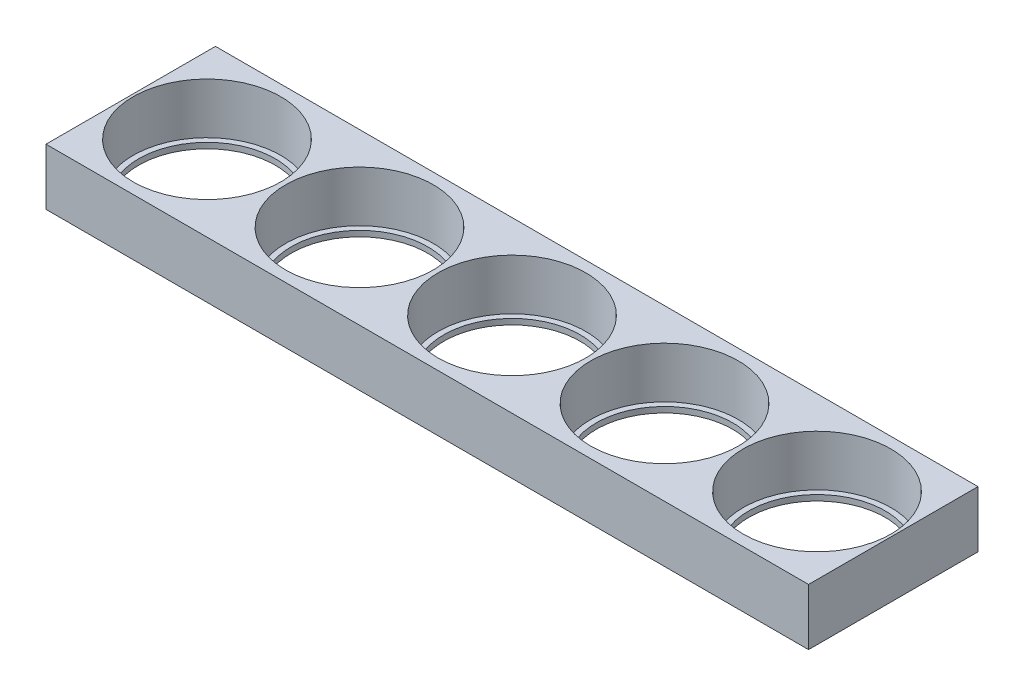
ISO-10303-21;
HEADER;
FILE_DESCRIPTION(('STEP AP214'),'2;1');
FILE_NAME('part.step','',(''),(''),'','','');
FILE_SCHEMA(('AUTOMOTIVE_DESIGN { 1 0 10303 214 1 1 1 1 }'));
ENDSEC;
DATA;
#1=APPLICATION_CONTEXT('core data for automotive mechanical design processes');
#2=APPLICATION_PROTOCOL_DEFINITION('international standard','automotive_design',2000,#1);
#3=PRODUCT_CONTEXT('',#1,'mechanical');
#4=PRODUCT('Part','Part','',(#3));
#5=PRODUCT_RELATED_PRODUCT_CATEGORY('part','',(#4));
#6=PRODUCT_DEFINITION_FORMATION('','',#4);
#7=PRODUCT_DEFINITION_CONTEXT('part definition',#1,'design');
#8=PRODUCT_DEFINITION('design','',#6,#7);
#9=PRODUCT_DEFINITION_SHAPE('','',#8);
#10=(LENGTH_UNIT() NAMED_UNIT(*) SI_UNIT(.MILLI.,.METRE.));
#11=(NAMED_UNIT(*) PLANE_ANGLE_UNIT() SI_UNIT($,.RADIAN.));
#12=(NAMED_UNIT(*) SI_UNIT($,.STERADIAN.) SOLID_ANGLE_UNIT());
#13=UNCERTAINTY_MEASURE_WITH_UNIT(LENGTH_MEASURE(1.E-05),#10,'distance_accuracy_value','');
#14=(GEOMETRIC_REPRESENTATION_CONTEXT(3) GLOBAL_UNCERTAINTY_ASSIGNED_CONTEXT((#13)) GLOBAL_UNIT_ASSIGNED_CONTEXT((#10,
#11,#12)) REPRESENTATION_CONTEXT('',''));
#15=CARTESIAN_POINT('',(0.,0.,0.));
#16=DIRECTION('',(0.,0.,1.));
#17=DIRECTION('',(1.,0.,0.));
#18=AXIS2_PLACEMENT_3D('',#15,#16,#17);
#19=CARTESIAN_POINT('',(0.,10.,0.));
#20=DIRECTION('',(0.,-1.,0.));
#21=DIRECTION('',(0.,0.,-1.));
#22=AXIS2_PLACEMENT_3D('',#19,#20,#21);
#23=PLANE('',#22);
#24=DIRECTION('',(1.,0.,0.));
#25=VECTOR('',#24,1.);
#26=CARTESIAN_POINT('',(-13.5,10.,15.));
#27=LINE('',#26,#25);
#28=CARTESIAN_POINT('',(-67.5,10.,15.));
#29=VERTEX_POINT('',#28);
#30=CARTESIAN_POINT('',(67.5,10.,15.));
#31=VERTEX_POINT('',#30);
#32=EDGE_CURVE('E61',#29,#31,#27,.T.);
#33=ORIENTED_EDGE('',*,*,#32,.T.);
#34=DIRECTION('',(0.,0.,-1.));
#35=VECTOR('',#34,1.);
#36=CARTESIAN_POINT('',(67.5,10.,15.));
#37=LINE('',#36,#35);
#38=CARTESIAN_POINT('',(67.5,10.,-15.));
#39=VERTEX_POINT('',#38);
#40=EDGE_CURVE('E105',#31,#39,#37,.T.);
#41=ORIENTED_EDGE('',*,*,#40,.T.);
#42=DIRECTION('',(-1.,0.,0.));
#43=VECTOR('',#42,1.);
#44=CARTESIAN_POINT('',(-13.5,10.,-15.));
#45=LINE('',#44,#43);
#46=CARTESIAN_POINT('',(-67.5,10.,-15.));
#47=VERTEX_POINT('',#46);
#48=EDGE_CURVE('E98',#39,#47,#45,.T.);
#49=ORIENTED_EDGE('',*,*,#48,.T.);
#50=DIRECTION('',(0.,0.,1.));
#51=VECTOR('',#50,1.);
#52=CARTESIAN_POINT('',(-67.5,10.,15.));
#53=LINE('',#52,#51);
#54=EDGE_CURVE('E132',#47,#29,#53,.T.);
#55=ORIENTED_EDGE('',*,*,#54,.T.);
#56=EDGE_LOOP('',(#33,#41,#49,#55));
#57=FACE_BOUND('',#56,.T.);
#58=CARTESIAN_POINT('',(0.,10.,0.));
#59=DIRECTION('',(0.,1.,0.));
#60=DIRECTION('',(0.,0.,1.));
#61=AXIS2_PLACEMENT_3D('',#58,#59,#60);
#62=CIRCLE('',#61,13.075);
#63=CARTESIAN_POINT('',(0.,10.,13.075));
#64=VERTEX_POINT('',#63);
#65=EDGE_CURVE('E151',#64,#64,#62,.T.);
#66=ORIENTED_EDGE('',*,*,#65,.F.);
#67=EDGE_LOOP('',(#66));
#68=FACE_BOUND('',#67,.T.);
#69=CARTESIAN_POINT('',(-27.,10.,0.));
#70=DIRECTION('',(0.,1.,0.));
#71=DIRECTION('',(0.,0.,1.));
#72=AXIS2_PLACEMENT_3D('',#69,#70,#71);
#73=CIRCLE('',#72,13.075);
#74=CARTESIAN_POINT('',(-27.,10.,13.075));
#75=VERTEX_POINT('',#74);
#76=EDGE_CURVE('E142',#75,#75,#73,.T.);
#77=ORIENTED_EDGE('',*,*,#76,.F.);
#78=EDGE_LOOP('',(#77));
#79=FACE_BOUND('',#78,.T.);
#80=CARTESIAN_POINT('',(-54.,10.,0.));
#81=DIRECTION('',(0.,1.,0.));
#82=DIRECTION('',(0.,0.,1.));
#83=AXIS2_PLACEMENT_3D('',#80,#81,#82);
#84=CIRCLE('',#83,13.075);
#85=CARTESIAN_POINT('',(-54.,10.,13.075));
#86=VERTEX_POINT('',#85);
#87=EDGE_CURVE('E127',#86,#86,#84,.T.);
#88=ORIENTED_EDGE('',*,*,#87,.F.);
#89=EDGE_LOOP('',(#88));
#90=FACE_BOUND('',#89,.T.);
#91=CARTESIAN_POINT('',(27.,10.,0.));
#92=DIRECTION('',(0.,1.,0.));
#93=DIRECTION('',(0.,0.,1.));
#94=AXIS2_PLACEMENT_3D('',#91,#92,#93);
#95=CIRCLE('',#94,13.075);
#96=CARTESIAN_POINT('',(27.,10.,13.075));
#97=VERTEX_POINT('',#96);
#98=EDGE_CURVE('E123',#97,#97,#95,.T.);
#99=ORIENTED_EDGE('',*,*,#98,.F.);
#100=EDGE_LOOP('',(#99));
#101=FACE_BOUND('',#100,.T.);
#102=CARTESIAN_POINT('',(54.,10.,0.));
#103=DIRECTION('',(0.,1.,0.));
#104=DIRECTION('',(0.,0.,1.));
#105=AXIS2_PLACEMENT_3D('',#102,#103,#104);
#106=CIRCLE('',#105,13.075);
#107=CARTESIAN_POINT('',(54.,10.,13.075));
#108=VERTEX_POINT('',#107);
#109=EDGE_CURVE('E112',#108,#108,#106,.T.);
#110=ORIENTED_EDGE('',*,*,#109,.F.);
#111=EDGE_LOOP('',(#110));
#112=FACE_BOUND('',#111,.T.);
#113=ADVANCED_FACE('F43',(#57,#68,#79,#90,#101,#112),#23,.F.);
#114=CARTESIAN_POINT('',(0.,0.,0.));
#115=DIRECTION('',(0.,-1.,0.));
#116=DIRECTION('',(0.,0.,-1.));
#117=AXIS2_PLACEMENT_3D('',#114,#115,#116);
#118=PLANE('',#117);
#119=DIRECTION('',(-1.,0.,0.));
#120=VECTOR('',#119,1.);
#121=CARTESIAN_POINT('',(-13.5,0.,-15.));
#122=LINE('',#121,#120);
#123=CARTESIAN_POINT('',(67.5,0.,-15.));
#124=VERTEX_POINT('',#123);
#125=CARTESIAN_POINT('',(-67.5,0.,-15.));
#126=VERTEX_POINT('',#125);
#127=EDGE_CURVE('E73',#124,#126,#122,.T.);
#128=ORIENTED_EDGE('',*,*,#127,.F.);
#129=DIRECTION('',(0.,0.,-1.));
#130=VECTOR('',#129,1.);
#131=CARTESIAN_POINT('',(67.5,0.,15.));
#132=LINE('',#131,#130);
#133=CARTESIAN_POINT('',(67.5,0.,15.));
#134=VERTEX_POINT('',#133);
#135=EDGE_CURVE('E104',#134,#124,#132,.T.);
#136=ORIENTED_EDGE('',*,*,#135,.F.);
#137=DIRECTION('',(1.,0.,0.));
#138=VECTOR('',#137,1.);
#139=CARTESIAN_POINT('',(-13.5,0.,15.));
#140=LINE('',#139,#138);
#141=CARTESIAN_POINT('',(-67.5,0.,15.));
#142=VERTEX_POINT('',#141);
#143=EDGE_CURVE('E86',#142,#134,#140,.T.);
#144=ORIENTED_EDGE('',*,*,#143,.F.);
#145=DIRECTION('',(0.,0.,1.));
#146=VECTOR('',#145,1.);
#147=CARTESIAN_POINT('',(-67.5,0.,15.));
#148=LINE('',#147,#146);
#149=EDGE_CURVE('E131',#126,#142,#148,.T.);
#150=ORIENTED_EDGE('',*,*,#149,.F.);
#151=EDGE_LOOP('',(#128,#136,#144,#150));
#152=FACE_BOUND('',#151,.T.);
#153=CARTESIAN_POINT('',(0.,0.,0.));
#154=DIRECTION('',(0.,1.,0.));
#155=DIRECTION('',(0.,0.,1.));
#156=AXIS2_PLACEMENT_3D('',#153,#154,#155);
#157=CIRCLE('',#156,12.075);
#158=CARTESIAN_POINT('',(0.,0.,12.075));
#159=VERTEX_POINT('',#158);
#160=EDGE_CURVE('E146',#159,#159,#157,.T.);
#161=ORIENTED_EDGE('',*,*,#160,.T.);
#162=EDGE_LOOP('',(#161));
#163=FACE_BOUND('',#162,.T.);
#164=CARTESIAN_POINT('',(-27.,0.,0.));
#165=DIRECTION('',(0.,1.,0.));
#166=DIRECTION('',(0.,0.,1.));
#167=AXIS2_PLACEMENT_3D('',#164,#165,#166);
#168=CIRCLE('',#167,12.075);
#169=CARTESIAN_POINT('',(-27.,0.,12.075));
#170=VERTEX_POINT('',#169);
#171=EDGE_CURVE('E456',#170,#170,#168,.T.);
#172=ORIENTED_EDGE('',*,*,#171,.T.);
#173=EDGE_LOOP('',(#172));
#174=FACE_BOUND('',#173,.T.);
#175=CARTESIAN_POINT('',(-54.,0.,0.));
#176=DIRECTION('',(0.,1.,0.));
#177=DIRECTION('',(0.,0.,1.));
#178=AXIS2_PLACEMENT_3D('',#175,#176,#177);
#179=CIRCLE('',#178,12.075);
#180=CARTESIAN_POINT('',(-54.,0.,12.075));
#181=VERTEX_POINT('',#180);
#182=EDGE_CURVE('E448',#181,#181,#179,.T.);
#183=ORIENTED_EDGE('',*,*,#182,.T.);
#184=EDGE_LOOP('',(#183));
#185=FACE_BOUND('',#184,.T.);
#186=CARTESIAN_POINT('',(27.,0.,0.));
#187=DIRECTION('',(0.,1.,0.));
#188=DIRECTION('',(0.,0.,1.));
#189=AXIS2_PLACEMENT_3D('',#186,#187,#188);
#190=CIRCLE('',#189,12.075);
#191=CARTESIAN_POINT('',(27.,0.,12.075));
#192=VERTEX_POINT('',#191);
#193=EDGE_CURVE('E441',#192,#192,#190,.T.);
#194=ORIENTED_EDGE('',*,*,#193,.T.);
#195=EDGE_LOOP('',(#194));
#196=FACE_BOUND('',#195,.T.);
#197=CARTESIAN_POINT('',(54.,0.,0.));
#198=DIRECTION('',(0.,1.,0.));
#199=DIRECTION('',(0.,0.,1.));
#200=AXIS2_PLACEMENT_3D('',#197,#198,#199);
#201=CIRCLE('',#200,12.075);
#202=CARTESIAN_POINT('',(54.,0.,12.075));
#203=VERTEX_POINT('',#202);
#204=EDGE_CURVE('E436',#203,#203,#201,.T.);
#205=ORIENTED_EDGE('',*,*,#204,.T.);
#206=EDGE_LOOP('',(#205));
#207=FACE_BOUND('',#206,.T.);
#208=ADVANCED_FACE('F109',(#152,#163,#174,#185,#196,#207),#118,.T.);
#209=CARTESIAN_POINT('',(-13.5,10.,-15.));
#210=DIRECTION('',(0.,0.,1.));
#211=DIRECTION('',(1.,0.,0.));
#212=AXIS2_PLACEMENT_3D('',#209,#210,#211);
#213=PLANE('',#212);
#214=ORIENTED_EDGE('',*,*,#127,.T.);
#215=DIRECTION('',(0.,-1.,0.));
#216=VECTOR('',#215,1.);
#217=CARTESIAN_POINT('',(-67.5,10.,-15.));
#218=LINE('',#217,#216);
#219=EDGE_CURVE('E139',#47,#126,#218,.T.);
#220=ORIENTED_EDGE('',*,*,#219,.F.);
#221=ORIENTED_EDGE('',*,*,#48,.F.);
#222=DIRECTION('',(0.,-1.,0.));
#223=VECTOR('',#222,1.);
#224=CARTESIAN_POINT('',(67.5,10.,-15.));
#225=LINE('',#224,#223);
#226=EDGE_CURVE('E107',#39,#124,#225,.T.);
#227=ORIENTED_EDGE('',*,*,#226,.T.);
#228=EDGE_LOOP('',(#214,#220,#221,#227));
#229=FACE_BOUND('',#228,.T.);
#230=ADVANCED_FACE('F45',(#229),#213,.F.);
#231=CARTESIAN_POINT('',(-13.5,10.,15.));
#232=DIRECTION('',(0.,0.,-1.));
#233=DIRECTION('',(-1.,0.,0.));
#234=AXIS2_PLACEMENT_3D('',#231,#232,#233);
#235=PLANE('',#234);
#236=ORIENTED_EDGE('',*,*,#143,.T.);
#237=DIRECTION('',(0.,-1.,0.));
#238=VECTOR('',#237,1.);
#239=CARTESIAN_POINT('',(67.5,10.,15.));
#240=LINE('',#239,#238);
#241=EDGE_CURVE('E89',#31,#134,#240,.T.);
#242=ORIENTED_EDGE('',*,*,#241,.F.);
#243=ORIENTED_EDGE('',*,*,#32,.F.);
#244=DIRECTION('',(0.,-1.,0.));
#245=VECTOR('',#244,1.);
#246=CARTESIAN_POINT('',(-67.5,10.,15.));
#247=LINE('',#246,#245);
#248=EDGE_CURVE('E92',#29,#142,#247,.T.);
#249=ORIENTED_EDGE('',*,*,#248,.T.);
#250=EDGE_LOOP('',(#236,#242,#243,#249));
#251=FACE_BOUND('',#250,.T.);
#252=ADVANCED_FACE('F88',(#251),#235,.F.);
#253=CARTESIAN_POINT('',(0.,10.,0.));
#254=DIRECTION('',(0.,-1.,0.));
#255=DIRECTION('',(0.,0.,-1.));
#256=AXIS2_PLACEMENT_3D('',#253,#254,#255);
#257=CYLINDRICAL_SURFACE('',#256,13.075);
#258=CARTESIAN_POINT('',(0.,0.999999999999999,0.));
#259=DIRECTION('',(0.,1.,0.));
#260=DIRECTION('',(0.,0.,1.));
#261=AXIS2_PLACEMENT_3D('',#258,#259,#260);
#262=CIRCLE('',#261,13.075);
#263=CARTESIAN_POINT('',(0.,0.999999999999999,13.075));
#264=VERTEX_POINT('',#263);
#265=EDGE_CURVE('E162',#264,#264,#262,.T.);
#266=ORIENTED_EDGE('',*,*,#265,.F.);
#267=EDGE_LOOP('',(#266));
#268=FACE_BOUND('',#267,.T.);
#269=ORIENTED_EDGE('',*,*,#65,.T.);
#270=EDGE_LOOP('',(#269));
#271=FACE_BOUND('',#270,.T.);
#272=ADVANCED_FACE('F228',(#268,#271),#257,.F.);
#273=CARTESIAN_POINT('',(0.,1.,0.));
#274=DIRECTION('',(0.,1.,0.));
#275=DIRECTION('',(0.,0.,1.));
#276=AXIS2_PLACEMENT_3D('',#273,#274,#275);
#277=PLANE('',#276);
#278=ORIENTED_EDGE('',*,*,#265,.T.);
#279=EDGE_LOOP('',(#278));
#280=FACE_BOUND('',#279,.T.);
#281=CARTESIAN_POINT('',(0.,1.,0.));
#282=DIRECTION('',(0.,1.,0.));
#283=DIRECTION('',(0.,0.,1.));
#284=AXIS2_PLACEMENT_3D('',#281,#282,#283);
#285=CIRCLE('',#284,12.075);
#286=CARTESIAN_POINT('',(0.,1.,12.075));
#287=VERTEX_POINT('',#286);
#288=EDGE_CURVE('E147',#287,#287,#285,.T.);
#289=ORIENTED_EDGE('',*,*,#288,.F.);
#290=EDGE_LOOP('',(#289));
#291=FACE_BOUND('',#290,.T.);
#292=ADVANCED_FACE('F224',(#280,#291),#277,.T.);
#293=CARTESIAN_POINT('',(0.,1.,0.));
#294=DIRECTION('',(0.,-1.,0.));
#295=DIRECTION('',(0.,0.,-1.));
#296=AXIS2_PLACEMENT_3D('',#293,#294,#295);
#297=CYLINDRICAL_SURFACE('',#296,12.075);
#298=ORIENTED_EDGE('',*,*,#288,.T.);
#299=EDGE_LOOP('',(#298));
#300=FACE_BOUND('',#299,.T.);
#301=ORIENTED_EDGE('',*,*,#160,.F.);
#302=EDGE_LOOP('',(#301));
#303=FACE_BOUND('',#302,.T.);
#304=ADVANCED_FACE('F220',(#300,#303),#297,.F.);
#305=CARTESIAN_POINT('',(-27.,10.,0.));
#306=DIRECTION('',(0.,-1.,0.));
#307=DIRECTION('',(0.,0.,-1.));
#308=AXIS2_PLACEMENT_3D('',#305,#306,#307);
#309=CYLINDRICAL_SURFACE('',#308,13.075);
#310=CARTESIAN_POINT('',(-27.,0.999999999999999,0.));
#311=DIRECTION('',(0.,1.,0.));
#312=DIRECTION('',(0.,0.,1.));
#313=AXIS2_PLACEMENT_3D('',#310,#311,#312);
#314=CIRCLE('',#313,13.075);
#315=CARTESIAN_POINT('',(-27.,0.999999999999999,13.075));
#316=VERTEX_POINT('',#315);
#317=EDGE_CURVE('E168',#316,#316,#314,.T.);
#318=ORIENTED_EDGE('',*,*,#317,.F.);
#319=EDGE_LOOP('',(#318));
#320=FACE_BOUND('',#319,.T.);
#321=ORIENTED_EDGE('',*,*,#76,.T.);
#322=EDGE_LOOP('',(#321));
#323=FACE_BOUND('',#322,.T.);
#324=ADVANCED_FACE('F216',(#320,#323),#309,.F.);
#325=CARTESIAN_POINT('',(-67.5,10.,15.));
#326=DIRECTION('',(1.,0.,0.));
#327=DIRECTION('',(0.,0.,-1.));
#328=AXIS2_PLACEMENT_3D('',#325,#326,#327);
#329=PLANE('',#328);
#330=ORIENTED_EDGE('',*,*,#149,.T.);
#331=ORIENTED_EDGE('',*,*,#248,.F.);
#332=ORIENTED_EDGE('',*,*,#54,.F.);
#333=ORIENTED_EDGE('',*,*,#219,.T.);
#334=EDGE_LOOP('',(#330,#331,#332,#333));
#335=FACE_BOUND('',#334,.T.);
#336=ADVANCED_FACE('F212',(#335),#329,.F.);
#337=CARTESIAN_POINT('',(-54.,10.,0.));
#338=DIRECTION('',(0.,-1.,0.));
#339=DIRECTION('',(0.,0.,-1.));
#340=AXIS2_PLACEMENT_3D('',#337,#338,#339);
#341=CYLINDRICAL_SURFACE('',#340,13.075);
#342=CARTESIAN_POINT('',(-54.,0.999999999999999,0.));
#343=DIRECTION('',(0.,1.,0.));
#344=DIRECTION('',(0.,0.,1.));
#345=AXIS2_PLACEMENT_3D('',#342,#343,#344);
#346=CIRCLE('',#345,13.075);
#347=CARTESIAN_POINT('',(-54.,0.999999999999999,13.075));
#348=VERTEX_POINT('',#347);
#349=EDGE_CURVE('E172',#348,#348,#346,.T.);
#350=ORIENTED_EDGE('',*,*,#349,.F.);
#351=EDGE_LOOP('',(#350));
#352=FACE_BOUND('',#351,.T.);
#353=ORIENTED_EDGE('',*,*,#87,.T.);
#354=EDGE_LOOP('',(#353));
#355=FACE_BOUND('',#354,.T.);
#356=ADVANCED_FACE('F185',(#352,#355),#341,.F.);
#357=CARTESIAN_POINT('',(27.,10.,0.));
#358=DIRECTION('',(0.,-1.,0.));
#359=DIRECTION('',(0.,0.,-1.));
#360=AXIS2_PLACEMENT_3D('',#357,#358,#359);
#361=CYLINDRICAL_SURFACE('',#360,13.075);
#362=CARTESIAN_POINT('',(27.,0.999999999999999,0.));
#363=DIRECTION('',(0.,1.,0.));
#364=DIRECTION('',(0.,0.,1.));
#365=AXIS2_PLACEMENT_3D('',#362,#363,#364);
#366=CIRCLE('',#365,13.075);
#367=CARTESIAN_POINT('',(27.,0.999999999999999,13.075));
#368=VERTEX_POINT('',#367);
#369=EDGE_CURVE('E53',#368,#368,#366,.T.);
#370=ORIENTED_EDGE('',*,*,#369,.F.);
#371=EDGE_LOOP('',(#370));
#372=FACE_BOUND('',#371,.T.);
#373=ORIENTED_EDGE('',*,*,#98,.T.);
#374=EDGE_LOOP('',(#373));
#375=FACE_BOUND('',#374,.T.);
#376=ADVANCED_FACE('F182',(#372,#375),#361,.F.);
#377=CARTESIAN_POINT('',(67.5,10.,15.));
#378=DIRECTION('',(-1.,0.,0.));
#379=DIRECTION('',(0.,0.,1.));
#380=AXIS2_PLACEMENT_3D('',#377,#378,#379);
#381=PLANE('',#380);
#382=ORIENTED_EDGE('',*,*,#135,.T.);
#383=ORIENTED_EDGE('',*,*,#226,.F.);
#384=ORIENTED_EDGE('',*,*,#40,.F.);
#385=ORIENTED_EDGE('',*,*,#241,.T.);
#386=EDGE_LOOP('',(#382,#383,#384,#385));
#387=FACE_BOUND('',#386,.T.);
#388=ADVANCED_FACE('F102',(#387),#381,.F.);
#389=CARTESIAN_POINT('',(54.,10.,0.));
#390=DIRECTION('',(0.,-1.,0.));
#391=DIRECTION('',(0.,0.,-1.));
#392=AXIS2_PLACEMENT_3D('',#389,#390,#391);
#393=CYLINDRICAL_SURFACE('',#392,13.075);
#394=CARTESIAN_POINT('',(54.,0.999999999999999,0.));
#395=DIRECTION('',(0.,1.,0.));
#396=DIRECTION('',(0.,0.,1.));
#397=AXIS2_PLACEMENT_3D('',#394,#395,#396);
#398=CIRCLE('',#397,13.075);
#399=CARTESIAN_POINT('',(54.,0.999999999999999,13.075));
#400=VERTEX_POINT('',#399);
#401=EDGE_CURVE('E11',#400,#400,#398,.T.);
#402=ORIENTED_EDGE('',*,*,#401,.F.);
#403=EDGE_LOOP('',(#402));
#404=FACE_BOUND('',#403,.T.);
#405=ORIENTED_EDGE('',*,*,#109,.T.);
#406=EDGE_LOOP('',(#405));
#407=FACE_BOUND('',#406,.T.);
#408=ADVANCED_FACE('F194',(#404,#407),#393,.F.);
#409=CARTESIAN_POINT('',(-27.,1.,0.));
#410=DIRECTION('',(0.,1.,0.));
#411=DIRECTION('',(0.,0.,1.));
#412=AXIS2_PLACEMENT_3D('',#409,#410,#411);
#413=PLANE('',#412);
#414=ORIENTED_EDGE('',*,*,#317,.T.);
#415=EDGE_LOOP('',(#414));
#416=FACE_BOUND('',#415,.T.);
#417=CARTESIAN_POINT('',(-27.,1.,0.));
#418=DIRECTION('',(0.,1.,0.));
#419=DIRECTION('',(0.,0.,1.));
#420=AXIS2_PLACEMENT_3D('',#417,#418,#419);
#421=CIRCLE('',#420,12.075);
#422=CARTESIAN_POINT('',(-27.,1.,12.075));
#423=VERTEX_POINT('',#422);
#424=EDGE_CURVE('E118',#423,#423,#421,.T.);
#425=ORIENTED_EDGE('',*,*,#424,.F.);
#426=EDGE_LOOP('',(#425));
#427=FACE_BOUND('',#426,.T.);
#428=ADVANCED_FACE('F196',(#416,#427),#413,.T.);
#429=CARTESIAN_POINT('',(-27.,1.,0.));
#430=DIRECTION('',(0.,-1.,0.));
#431=DIRECTION('',(0.,0.,-1.));
#432=AXIS2_PLACEMENT_3D('',#429,#430,#431);
#433=CYLINDRICAL_SURFACE('',#432,12.075);
#434=ORIENTED_EDGE('',*,*,#424,.T.);
#435=EDGE_LOOP('',(#434));
#436=FACE_BOUND('',#435,.T.);
#437=ORIENTED_EDGE('',*,*,#171,.F.);
#438=EDGE_LOOP('',(#437));
#439=FACE_BOUND('',#438,.T.);
#440=ADVANCED_FACE('F203',(#436,#439),#433,.F.);
#441=CARTESIAN_POINT('',(-54.,1.,0.));
#442=DIRECTION('',(0.,1.,0.));
#443=DIRECTION('',(0.,0.,1.));
#444=AXIS2_PLACEMENT_3D('',#441,#442,#443);
#445=PLANE('',#444);
#446=ORIENTED_EDGE('',*,*,#349,.T.);
#447=EDGE_LOOP('',(#446));
#448=FACE_BOUND('',#447,.T.);
#449=CARTESIAN_POINT('',(-54.,1.,0.));
#450=DIRECTION('',(0.,1.,0.));
#451=DIRECTION('',(0.,0.,1.));
#452=AXIS2_PLACEMENT_3D('',#449,#450,#451);
#453=CIRCLE('',#452,12.075);
#454=CARTESIAN_POINT('',(-54.,1.,12.075));
#455=VERTEX_POINT('',#454);
#456=EDGE_CURVE('E452',#455,#455,#453,.T.);
#457=ORIENTED_EDGE('',*,*,#456,.F.);
#458=EDGE_LOOP('',(#457));
#459=FACE_BOUND('',#458,.T.);
#460=ADVANCED_FACE('F354',(#448,#459),#445,.T.);
#461=CARTESIAN_POINT('',(-54.,1.,0.));
#462=DIRECTION('',(0.,-1.,0.));
#463=DIRECTION('',(0.,0.,-1.));
#464=AXIS2_PLACEMENT_3D('',#461,#462,#463);
#465=CYLINDRICAL_SURFACE('',#464,12.075);
#466=ORIENTED_EDGE('',*,*,#456,.T.);
#467=EDGE_LOOP('',(#466));
#468=FACE_BOUND('',#467,.T.);
#469=ORIENTED_EDGE('',*,*,#182,.F.);
#470=EDGE_LOOP('',(#469));
#471=FACE_BOUND('',#470,.T.);
#472=ADVANCED_FACE('F364',(#468,#471),#465,.F.);
#473=CARTESIAN_POINT('',(27.,1.,0.));
#474=DIRECTION('',(0.,1.,0.));
#475=DIRECTION('',(0.,0.,1.));
#476=AXIS2_PLACEMENT_3D('',#473,#474,#475);
#477=PLANE('',#476);
#478=ORIENTED_EDGE('',*,*,#369,.T.);
#479=EDGE_LOOP('',(#478));
#480=FACE_BOUND('',#479,.T.);
#481=CARTESIAN_POINT('',(27.,1.,0.));
#482=DIRECTION('',(0.,1.,0.));
#483=DIRECTION('',(0.,0.,1.));
#484=AXIS2_PLACEMENT_3D('',#481,#482,#483);
#485=CIRCLE('',#484,12.075);
#486=CARTESIAN_POINT('',(27.,1.,12.075));
#487=VERTEX_POINT('',#486);
#488=EDGE_CURVE('E444',#487,#487,#485,.T.);
#489=ORIENTED_EDGE('',*,*,#488,.F.);
#490=EDGE_LOOP('',(#489));
#491=FACE_BOUND('',#490,.T.);
#492=ADVANCED_FACE('F179',(#480,#491),#477,.T.);
#493=CARTESIAN_POINT('',(27.,1.,0.));
#494=DIRECTION('',(0.,-1.,0.));
#495=DIRECTION('',(0.,0.,-1.));
#496=AXIS2_PLACEMENT_3D('',#493,#494,#495);
#497=CYLINDRICAL_SURFACE('',#496,12.075);
#498=ORIENTED_EDGE('',*,*,#488,.T.);
#499=EDGE_LOOP('',(#498));
#500=FACE_BOUND('',#499,.T.);
#501=ORIENTED_EDGE('',*,*,#193,.F.);
#502=EDGE_LOOP('',(#501));
#503=FACE_BOUND('',#502,.T.);
#504=ADVANCED_FACE('F385',(#500,#503),#497,.F.);
#505=CARTESIAN_POINT('',(54.,1.,0.));
#506=DIRECTION('',(0.,1.,0.));
#507=DIRECTION('',(0.,0.,1.));
#508=AXIS2_PLACEMENT_3D('',#505,#506,#507);
#509=PLANE('',#508);
#510=ORIENTED_EDGE('',*,*,#401,.T.);
#511=EDGE_LOOP('',(#510));
#512=FACE_BOUND('',#511,.T.);
#513=CARTESIAN_POINT('',(54.,1.,0.));
#514=DIRECTION('',(0.,1.,0.));
#515=DIRECTION('',(0.,0.,1.));
#516=AXIS2_PLACEMENT_3D('',#513,#514,#515);
#517=CIRCLE('',#516,12.075);
#518=CARTESIAN_POINT('',(54.,1.,12.075));
#519=VERTEX_POINT('',#518);
#520=EDGE_CURVE('E433',#519,#519,#517,.T.);
#521=ORIENTED_EDGE('',*,*,#520,.F.);
#522=EDGE_LOOP('',(#521));
#523=FACE_BOUND('',#522,.T.);
#524=ADVANCED_FACE('F395',(#512,#523),#509,.T.);
#525=CARTESIAN_POINT('',(54.,1.,0.));
#526=DIRECTION('',(0.,-1.,0.));
#527=DIRECTION('',(0.,0.,-1.));
#528=AXIS2_PLACEMENT_3D('',#525,#526,#527);
#529=CYLINDRICAL_SURFACE('',#528,12.075);
#530=ORIENTED_EDGE('',*,*,#520,.T.);
#531=EDGE_LOOP('',(#530));
#532=FACE_BOUND('',#531,.T.);
#533=ORIENTED_EDGE('',*,*,#204,.F.);
#534=EDGE_LOOP('',(#533));
#535=FACE_BOUND('',#534,.T.);
#536=ADVANCED_FACE('F406',(#532,#535),#529,.F.);
#537=CLOSED_SHELL('',(#113,#208,#230,#252,#272,#292,#304,#324,#336,#356,#376,#388,#408,#428,
#440,#460,#472,#492,#504,#524,#536));
#538=MANIFOLD_SOLID_BREP('B2',#537);
#539=ADVANCED_BREP_SHAPE_REPRESENTATION('',(#18,#538),#14);
#540=SHAPE_DEFINITION_REPRESENTATION(#9,#539);
ENDSEC;
END-ISO-10303-21;
